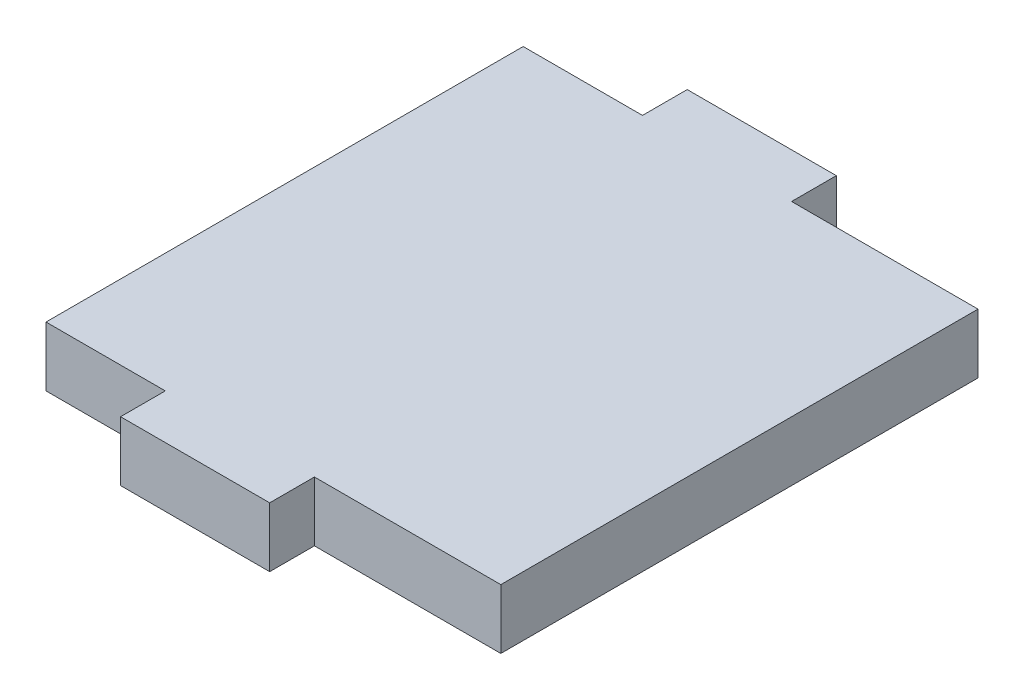
ISO-10303-21;
HEADER;
FILE_DESCRIPTION(('STEP AP214'),'2;1');
FILE_NAME('part.step','',(''),(''),'','','');
FILE_SCHEMA(('AUTOMOTIVE_DESIGN { 1 0 10303 214 1 1 1 1 }'));
ENDSEC;
DATA;
#1=APPLICATION_CONTEXT('core data for automotive mechanical design processes');
#2=APPLICATION_PROTOCOL_DEFINITION('international standard','automotive_design',2000,#1);
#3=PRODUCT_CONTEXT('',#1,'mechanical');
#4=PRODUCT('Part','Part','',(#3));
#5=PRODUCT_RELATED_PRODUCT_CATEGORY('part','',(#4));
#6=PRODUCT_DEFINITION_FORMATION('','',#4);
#7=PRODUCT_DEFINITION_CONTEXT('part definition',#1,'design');
#8=PRODUCT_DEFINITION('design','',#6,#7);
#9=PRODUCT_DEFINITION_SHAPE('','',#8);
#10=(LENGTH_UNIT() NAMED_UNIT(*) SI_UNIT(.MILLI.,.METRE.));
#11=(NAMED_UNIT(*) PLANE_ANGLE_UNIT() SI_UNIT($,.RADIAN.));
#12=(NAMED_UNIT(*) SI_UNIT($,.STERADIAN.) SOLID_ANGLE_UNIT());
#13=UNCERTAINTY_MEASURE_WITH_UNIT(LENGTH_MEASURE(1.E-05),#10,'distance_accuracy_value','');
#14=(GEOMETRIC_REPRESENTATION_CONTEXT(3) GLOBAL_UNCERTAINTY_ASSIGNED_CONTEXT((#13)) GLOBAL_UNIT_ASSIGNED_CONTEXT((#10,
#11,#12)) REPRESENTATION_CONTEXT('',''));
#15=CARTESIAN_POINT('',(0.,0.,0.));
#16=DIRECTION('',(0.,0.,1.));
#17=DIRECTION('',(1.,0.,0.));
#18=AXIS2_PLACEMENT_3D('',#15,#16,#17);
#19=CARTESIAN_POINT('',(2.75,4.,16.));
#20=DIRECTION('',(-1.,0.,0.));
#21=DIRECTION('',(0.,0.,1.));
#22=AXIS2_PLACEMENT_3D('',#19,#20,#21);
#23=PLANE('',#22);
#24=DIRECTION('',(0.,0.,-1.));
#25=VECTOR('',#24,1.);
#26=CARTESIAN_POINT('',(2.75,0.,16.));
#27=LINE('',#26,#25);
#28=CARTESIAN_POINT('',(2.75,0.,19.));
#29=VERTEX_POINT('',#28);
#30=CARTESIAN_POINT('',(2.75,0.,16.));
#31=VERTEX_POINT('',#30);
#32=EDGE_CURVE('E155',#29,#31,#27,.T.);
#33=ORIENTED_EDGE('',*,*,#32,.T.);
#34=DIRECTION('',(0.,-1.,0.));
#35=VECTOR('',#34,1.);
#36=CARTESIAN_POINT('',(2.75,4.,16.));
#37=LINE('',#36,#35);
#38=CARTESIAN_POINT('',(2.75,4.,16.));
#39=VERTEX_POINT('',#38);
#40=EDGE_CURVE('E11',#39,#31,#37,.T.);
#41=ORIENTED_EDGE('',*,*,#40,.F.);
#42=DIRECTION('',(0.,0.,-1.));
#43=VECTOR('',#42,1.);
#44=CARTESIAN_POINT('',(2.75,4.,16.));
#45=LINE('',#44,#43);
#46=CARTESIAN_POINT('',(2.75,4.,19.));
#47=VERTEX_POINT('',#46);
#48=EDGE_CURVE('E177',#47,#39,#45,.T.);
#49=ORIENTED_EDGE('',*,*,#48,.F.);
#50=DIRECTION('',(0.,-1.,0.));
#51=VECTOR('',#50,1.);
#52=CARTESIAN_POINT('',(2.75,4.,19.));
#53=LINE('',#52,#51);
#54=EDGE_CURVE('E151',#47,#29,#53,.T.);
#55=ORIENTED_EDGE('',*,*,#54,.T.);
#56=EDGE_LOOP('',(#33,#41,#49,#55));
#57=FACE_BOUND('',#56,.T.);
#58=ADVANCED_FACE('F35',(#57),#23,.F.);
#59=CARTESIAN_POINT('',(15.25,4.,16.));
#60=DIRECTION('',(0.,0.,-1.));
#61=DIRECTION('',(-1.,0.,0.));
#62=AXIS2_PLACEMENT_3D('',#59,#60,#61);
#63=PLANE('',#62);
#64=DIRECTION('',(1.,0.,0.));
#65=VECTOR('',#64,1.);
#66=CARTESIAN_POINT('',(15.25,0.,16.));
#67=LINE('',#66,#65);
#68=CARTESIAN_POINT('',(15.25,0.,16.));
#69=VERTEX_POINT('',#68);
#70=EDGE_CURVE('E158',#31,#69,#67,.T.);
#71=ORIENTED_EDGE('',*,*,#70,.T.);
#72=DIRECTION('',(0.,-1.,0.));
#73=VECTOR('',#72,1.);
#74=CARTESIAN_POINT('',(15.25,4.,16.));
#75=LINE('',#74,#73);
#76=CARTESIAN_POINT('',(15.25,4.,16.));
#77=VERTEX_POINT('',#76);
#78=EDGE_CURVE('E43',#77,#69,#75,.T.);
#79=ORIENTED_EDGE('',*,*,#78,.F.);
#80=DIRECTION('',(1.,0.,0.));
#81=VECTOR('',#80,1.);
#82=CARTESIAN_POINT('',(15.25,4.,16.));
#83=LINE('',#82,#81);
#84=EDGE_CURVE('E106',#39,#77,#83,.T.);
#85=ORIENTED_EDGE('',*,*,#84,.F.);
#86=ORIENTED_EDGE('',*,*,#40,.T.);
#87=EDGE_LOOP('',(#71,#79,#85,#86));
#88=FACE_BOUND('',#87,.T.);
#89=ADVANCED_FACE('F255',(#88),#63,.F.);
#90=CARTESIAN_POINT('',(15.25,4.,-16.));
#91=DIRECTION('',(-1.,0.,0.));
#92=DIRECTION('',(0.,0.,1.));
#93=AXIS2_PLACEMENT_3D('',#90,#91,#92);
#94=PLANE('',#93);
#95=DIRECTION('',(0.,0.,-1.));
#96=VECTOR('',#95,1.);
#97=CARTESIAN_POINT('',(15.25,0.,-16.));
#98=LINE('',#97,#96);
#99=CARTESIAN_POINT('',(15.25,0.,-16.));
#100=VERTEX_POINT('',#99);
#101=EDGE_CURVE('E160',#69,#100,#98,.T.);
#102=ORIENTED_EDGE('',*,*,#101,.T.);
#103=DIRECTION('',(0.,-1.,0.));
#104=VECTOR('',#103,1.);
#105=CARTESIAN_POINT('',(15.25,4.,-16.));
#106=LINE('',#105,#104);
#107=CARTESIAN_POINT('',(15.25,4.,-16.));
#108=VERTEX_POINT('',#107);
#109=EDGE_CURVE('E196',#108,#100,#106,.T.);
#110=ORIENTED_EDGE('',*,*,#109,.F.);
#111=DIRECTION('',(0.,0.,-1.));
#112=VECTOR('',#111,1.);
#113=CARTESIAN_POINT('',(15.25,4.,-16.));
#114=LINE('',#113,#112);
#115=EDGE_CURVE('E204',#77,#108,#114,.T.);
#116=ORIENTED_EDGE('',*,*,#115,.F.);
#117=ORIENTED_EDGE('',*,*,#78,.T.);
#118=EDGE_LOOP('',(#102,#110,#116,#117));
#119=FACE_BOUND('',#118,.T.);
#120=ADVANCED_FACE('F202',(#119),#94,.F.);
#121=CARTESIAN_POINT('',(2.75,4.,-16.));
#122=DIRECTION('',(0.,0.,1.));
#123=DIRECTION('',(1.,0.,0.));
#124=AXIS2_PLACEMENT_3D('',#121,#122,#123);
#125=PLANE('',#124);
#126=DIRECTION('',(-1.,0.,0.));
#127=VECTOR('',#126,1.);
#128=CARTESIAN_POINT('',(2.75,0.,-16.));
#129=LINE('',#128,#127);
#130=CARTESIAN_POINT('',(2.75,0.,-16.));
#131=VERTEX_POINT('',#130);
#132=EDGE_CURVE('E162',#100,#131,#129,.T.);
#133=ORIENTED_EDGE('',*,*,#132,.T.);
#134=DIRECTION('',(0.,-1.,0.));
#135=VECTOR('',#134,1.);
#136=CARTESIAN_POINT('',(2.75,4.,-16.));
#137=LINE('',#136,#135);
#138=CARTESIAN_POINT('',(2.75,4.,-16.));
#139=VERTEX_POINT('',#138);
#140=EDGE_CURVE('E193',#139,#131,#137,.T.);
#141=ORIENTED_EDGE('',*,*,#140,.F.);
#142=DIRECTION('',(-1.,0.,0.));
#143=VECTOR('',#142,1.);
#144=CARTESIAN_POINT('',(2.75,4.,-16.));
#145=LINE('',#144,#143);
#146=EDGE_CURVE('E222',#108,#139,#145,.T.);
#147=ORIENTED_EDGE('',*,*,#146,.F.);
#148=ORIENTED_EDGE('',*,*,#109,.T.);
#149=EDGE_LOOP('',(#133,#141,#147,#148));
#150=FACE_BOUND('',#149,.T.);
#151=ADVANCED_FACE('F213',(#150),#125,.F.);
#152=CARTESIAN_POINT('',(2.75,4.,-19.));
#153=DIRECTION('',(-1.,0.,0.));
#154=DIRECTION('',(0.,0.,1.));
#155=AXIS2_PLACEMENT_3D('',#152,#153,#154);
#156=PLANE('',#155);
#157=DIRECTION('',(0.,0.,-1.));
#158=VECTOR('',#157,1.);
#159=CARTESIAN_POINT('',(2.75,0.,-19.));
#160=LINE('',#159,#158);
#161=CARTESIAN_POINT('',(2.75,0.,-19.));
#162=VERTEX_POINT('',#161);
#163=EDGE_CURVE('E164',#131,#162,#160,.T.);
#164=ORIENTED_EDGE('',*,*,#163,.T.);
#165=DIRECTION('',(0.,-1.,0.));
#166=VECTOR('',#165,1.);
#167=CARTESIAN_POINT('',(2.75,4.,-19.));
#168=LINE('',#167,#166);
#169=CARTESIAN_POINT('',(2.75,4.,-19.));
#170=VERTEX_POINT('',#169);
#171=EDGE_CURVE('E190',#170,#162,#168,.T.);
#172=ORIENTED_EDGE('',*,*,#171,.F.);
#173=DIRECTION('',(0.,0.,-1.));
#174=VECTOR('',#173,1.);
#175=CARTESIAN_POINT('',(2.75,4.,-19.));
#176=LINE('',#175,#174);
#177=EDGE_CURVE('E219',#139,#170,#176,.T.);
#178=ORIENTED_EDGE('',*,*,#177,.F.);
#179=ORIENTED_EDGE('',*,*,#140,.T.);
#180=EDGE_LOOP('',(#164,#172,#178,#179));
#181=FACE_BOUND('',#180,.T.);
#182=ADVANCED_FACE('F217',(#181),#156,.F.);
#183=CARTESIAN_POINT('',(-7.25000000000001,4.,-19.));
#184=DIRECTION('',(0.,0.,1.));
#185=DIRECTION('',(1.,0.,0.));
#186=AXIS2_PLACEMENT_3D('',#183,#184,#185);
#187=PLANE('',#186);
#188=DIRECTION('',(-1.,0.,0.));
#189=VECTOR('',#188,1.);
#190=CARTESIAN_POINT('',(-7.25000000000001,0.,-19.));
#191=LINE('',#190,#189);
#192=CARTESIAN_POINT('',(-7.25000000000001,0.,-19.));
#193=VERTEX_POINT('',#192);
#194=EDGE_CURVE('E166',#162,#193,#191,.T.);
#195=ORIENTED_EDGE('',*,*,#194,.T.);
#196=DIRECTION('',(0.,-1.,0.));
#197=VECTOR('',#196,1.);
#198=CARTESIAN_POINT('',(-7.25000000000001,4.,-19.));
#199=LINE('',#198,#197);
#200=CARTESIAN_POINT('',(-7.25000000000001,4.,-19.));
#201=VERTEX_POINT('',#200);
#202=EDGE_CURVE('E187',#201,#193,#199,.T.);
#203=ORIENTED_EDGE('',*,*,#202,.F.);
#204=DIRECTION('',(-1.,0.,0.));
#205=VECTOR('',#204,1.);
#206=CARTESIAN_POINT('',(-7.25000000000001,4.,-19.));
#207=LINE('',#206,#205);
#208=EDGE_CURVE('E221',#170,#201,#207,.T.);
#209=ORIENTED_EDGE('',*,*,#208,.F.);
#210=ORIENTED_EDGE('',*,*,#171,.T.);
#211=EDGE_LOOP('',(#195,#203,#209,#210));
#212=FACE_BOUND('',#211,.T.);
#213=ADVANCED_FACE('F268',(#212),#187,.F.);
#214=CARTESIAN_POINT('',(-7.25000000000001,4.,-16.));
#215=DIRECTION('',(1.,0.,0.));
#216=DIRECTION('',(0.,0.,-1.));
#217=AXIS2_PLACEMENT_3D('',#214,#215,#216);
#218=PLANE('',#217);
#219=DIRECTION('',(0.,0.,1.));
#220=VECTOR('',#219,1.);
#221=CARTESIAN_POINT('',(-7.25000000000001,0.,-16.));
#222=LINE('',#221,#220);
#223=CARTESIAN_POINT('',(-7.25000000000001,0.,-16.));
#224=VERTEX_POINT('',#223);
#225=EDGE_CURVE('E168',#193,#224,#222,.T.);
#226=ORIENTED_EDGE('',*,*,#225,.T.);
#227=DIRECTION('',(0.,-1.,0.));
#228=VECTOR('',#227,1.);
#229=CARTESIAN_POINT('',(-7.25000000000001,4.,-16.));
#230=LINE('',#229,#228);
#231=CARTESIAN_POINT('',(-7.25000000000001,4.,-16.));
#232=VERTEX_POINT('',#231);
#233=EDGE_CURVE('E184',#232,#224,#230,.T.);
#234=ORIENTED_EDGE('',*,*,#233,.F.);
#235=DIRECTION('',(0.,0.,1.));
#236=VECTOR('',#235,1.);
#237=CARTESIAN_POINT('',(-7.25000000000001,4.,-16.));
#238=LINE('',#237,#236);
#239=EDGE_CURVE('E224',#201,#232,#238,.T.);
#240=ORIENTED_EDGE('',*,*,#239,.F.);
#241=ORIENTED_EDGE('',*,*,#202,.T.);
#242=EDGE_LOOP('',(#226,#234,#240,#241));
#243=FACE_BOUND('',#242,.T.);
#244=ADVANCED_FACE('F271',(#243),#218,.F.);
#245=CARTESIAN_POINT('',(-15.25,4.,-16.));
#246=DIRECTION('',(0.,0.,1.));
#247=DIRECTION('',(1.,0.,0.));
#248=AXIS2_PLACEMENT_3D('',#245,#246,#247);
#249=PLANE('',#248);
#250=DIRECTION('',(-1.,0.,0.));
#251=VECTOR('',#250,1.);
#252=CARTESIAN_POINT('',(-15.25,0.,-16.));
#253=LINE('',#252,#251);
#254=CARTESIAN_POINT('',(-15.25,0.,-16.));
#255=VERTEX_POINT('',#254);
#256=EDGE_CURVE('E170',#224,#255,#253,.T.);
#257=ORIENTED_EDGE('',*,*,#256,.T.);
#258=DIRECTION('',(0.,-1.,0.));
#259=VECTOR('',#258,1.);
#260=CARTESIAN_POINT('',(-15.25,4.,-16.));
#261=LINE('',#260,#259);
#262=CARTESIAN_POINT('',(-15.25,4.,-16.));
#263=VERTEX_POINT('',#262);
#264=EDGE_CURVE('E181',#263,#255,#261,.T.);
#265=ORIENTED_EDGE('',*,*,#264,.F.);
#266=DIRECTION('',(-1.,0.,0.));
#267=VECTOR('',#266,1.);
#268=CARTESIAN_POINT('',(-15.25,4.,-16.));
#269=LINE('',#268,#267);
#270=EDGE_CURVE('E230',#232,#263,#269,.T.);
#271=ORIENTED_EDGE('',*,*,#270,.F.);
#272=ORIENTED_EDGE('',*,*,#233,.T.);
#273=EDGE_LOOP('',(#257,#265,#271,#272));
#274=FACE_BOUND('',#273,.T.);
#275=ADVANCED_FACE('F236',(#274),#249,.F.);
#276=CARTESIAN_POINT('',(-15.25,4.,16.));
#277=DIRECTION('',(1.,0.,0.));
#278=DIRECTION('',(0.,0.,-1.));
#279=AXIS2_PLACEMENT_3D('',#276,#277,#278);
#280=PLANE('',#279);
#281=DIRECTION('',(0.,0.,1.));
#282=VECTOR('',#281,1.);
#283=CARTESIAN_POINT('',(-15.25,0.,16.));
#284=LINE('',#283,#282);
#285=CARTESIAN_POINT('',(-15.25,0.,16.));
#286=VERTEX_POINT('',#285);
#287=EDGE_CURVE('E172',#255,#286,#284,.T.);
#288=ORIENTED_EDGE('',*,*,#287,.T.);
#289=DIRECTION('',(0.,-1.,0.));
#290=VECTOR('',#289,1.);
#291=CARTESIAN_POINT('',(-15.25,4.,16.));
#292=LINE('',#291,#290);
#293=CARTESIAN_POINT('',(-15.25,4.,16.));
#294=VERTEX_POINT('',#293);
#295=EDGE_CURVE('E146',#294,#286,#292,.T.);
#296=ORIENTED_EDGE('',*,*,#295,.F.);
#297=DIRECTION('',(0.,0.,1.));
#298=VECTOR('',#297,1.);
#299=CARTESIAN_POINT('',(-15.25,4.,16.));
#300=LINE('',#299,#298);
#301=EDGE_CURVE('E137',#263,#294,#300,.T.);
#302=ORIENTED_EDGE('',*,*,#301,.F.);
#303=ORIENTED_EDGE('',*,*,#264,.T.);
#304=EDGE_LOOP('',(#288,#296,#302,#303));
#305=FACE_BOUND('',#304,.T.);
#306=ADVANCED_FACE('F240',(#305),#280,.F.);
#307=CARTESIAN_POINT('',(-7.25000000000001,4.,16.));
#308=DIRECTION('',(0.,0.,-1.));
#309=DIRECTION('',(-1.,0.,0.));
#310=AXIS2_PLACEMENT_3D('',#307,#308,#309);
#311=PLANE('',#310);
#312=DIRECTION('',(1.,0.,0.));
#313=VECTOR('',#312,1.);
#314=CARTESIAN_POINT('',(-7.25000000000001,0.,16.));
#315=LINE('',#314,#313);
#316=CARTESIAN_POINT('',(-7.25000000000001,0.,16.));
#317=VERTEX_POINT('',#316);
#318=EDGE_CURVE('E145',#286,#317,#315,.T.);
#319=ORIENTED_EDGE('',*,*,#318,.T.);
#320=DIRECTION('',(0.,-1.,0.));
#321=VECTOR('',#320,1.);
#322=CARTESIAN_POINT('',(-7.25000000000001,4.,16.));
#323=LINE('',#322,#321);
#324=CARTESIAN_POINT('',(-7.25000000000001,4.,16.));
#325=VERTEX_POINT('',#324);
#326=EDGE_CURVE('E142',#325,#317,#323,.T.);
#327=ORIENTED_EDGE('',*,*,#326,.F.);
#328=DIRECTION('',(1.,0.,0.));
#329=VECTOR('',#328,1.);
#330=CARTESIAN_POINT('',(-7.25000000000001,4.,16.));
#331=LINE('',#330,#329);
#332=EDGE_CURVE('E131',#294,#325,#331,.T.);
#333=ORIENTED_EDGE('',*,*,#332,.F.);
#334=ORIENTED_EDGE('',*,*,#295,.T.);
#335=EDGE_LOOP('',(#319,#327,#333,#334));
#336=FACE_BOUND('',#335,.T.);
#337=ADVANCED_FACE('F143',(#336),#311,.F.);
#338=CARTESIAN_POINT('',(-7.25000000000001,4.,19.));
#339=DIRECTION('',(1.,0.,0.));
#340=DIRECTION('',(0.,0.,-1.));
#341=AXIS2_PLACEMENT_3D('',#338,#339,#340);
#342=PLANE('',#341);
#343=DIRECTION('',(0.,0.,1.));
#344=VECTOR('',#343,1.);
#345=CARTESIAN_POINT('',(-7.25000000000001,0.,19.));
#346=LINE('',#345,#344);
#347=CARTESIAN_POINT('',(-7.25000000000001,0.,19.));
#348=VERTEX_POINT('',#347);
#349=EDGE_CURVE('E92',#317,#348,#346,.T.);
#350=ORIENTED_EDGE('',*,*,#349,.T.);
#351=DIRECTION('',(0.,-1.,0.));
#352=VECTOR('',#351,1.);
#353=CARTESIAN_POINT('',(-7.25000000000001,4.,19.));
#354=LINE('',#353,#352);
#355=CARTESIAN_POINT('',(-7.25000000000001,4.,19.));
#356=VERTEX_POINT('',#355);
#357=EDGE_CURVE('E147',#356,#348,#354,.T.);
#358=ORIENTED_EDGE('',*,*,#357,.F.);
#359=DIRECTION('',(0.,0.,1.));
#360=VECTOR('',#359,1.);
#361=CARTESIAN_POINT('',(-7.25000000000001,4.,19.));
#362=LINE('',#361,#360);
#363=EDGE_CURVE('E135',#325,#356,#362,.T.);
#364=ORIENTED_EDGE('',*,*,#363,.F.);
#365=ORIENTED_EDGE('',*,*,#326,.T.);
#366=EDGE_LOOP('',(#350,#358,#364,#365));
#367=FACE_BOUND('',#366,.T.);
#368=ADVANCED_FACE('F149',(#367),#342,.F.);
#369=CARTESIAN_POINT('',(2.75,4.,19.));
#370=DIRECTION('',(0.,0.,-1.));
#371=DIRECTION('',(-1.,0.,0.));
#372=AXIS2_PLACEMENT_3D('',#369,#370,#371);
#373=PLANE('',#372);
#374=DIRECTION('',(1.,0.,0.));
#375=VECTOR('',#374,1.);
#376=CARTESIAN_POINT('',(2.75,0.,19.));
#377=LINE('',#376,#375);
#378=EDGE_CURVE('E98',#348,#29,#377,.T.);
#379=ORIENTED_EDGE('',*,*,#378,.T.);
#380=ORIENTED_EDGE('',*,*,#54,.F.);
#381=DIRECTION('',(1.,0.,0.));
#382=VECTOR('',#381,1.);
#383=CARTESIAN_POINT('',(2.75,4.,19.));
#384=LINE('',#383,#382);
#385=EDGE_CURVE('E51',#356,#47,#384,.T.);
#386=ORIENTED_EDGE('',*,*,#385,.F.);
#387=ORIENTED_EDGE('',*,*,#357,.T.);
#388=EDGE_LOOP('',(#379,#380,#386,#387));
#389=FACE_BOUND('',#388,.T.);
#390=ADVANCED_FACE('F244',(#389),#373,.F.);
#391=CARTESIAN_POINT('',(0.,4.,0.));
#392=DIRECTION('',(0.,-1.,0.));
#393=DIRECTION('',(0.,0.,-1.));
#394=AXIS2_PLACEMENT_3D('',#391,#392,#393);
#395=PLANE('',#394);
#396=ORIENTED_EDGE('',*,*,#48,.T.);
#397=ORIENTED_EDGE('',*,*,#84,.T.);
#398=ORIENTED_EDGE('',*,*,#115,.T.);
#399=ORIENTED_EDGE('',*,*,#146,.T.);
#400=ORIENTED_EDGE('',*,*,#177,.T.);
#401=ORIENTED_EDGE('',*,*,#208,.T.);
#402=ORIENTED_EDGE('',*,*,#239,.T.);
#403=ORIENTED_EDGE('',*,*,#270,.T.);
#404=ORIENTED_EDGE('',*,*,#301,.T.);
#405=ORIENTED_EDGE('',*,*,#332,.T.);
#406=ORIENTED_EDGE('',*,*,#363,.T.);
#407=ORIENTED_EDGE('',*,*,#385,.T.);
#408=EDGE_LOOP('',(#396,#397,#398,#399,#400,#401,#402,#403,#404,#405,#406,#407));
#409=FACE_BOUND('',#408,.T.);
#410=ADVANCED_FACE('F133',(#409),#395,.F.);
#411=CARTESIAN_POINT('',(0.,0.,0.));
#412=DIRECTION('',(0.,-1.,0.));
#413=DIRECTION('',(0.,0.,-1.));
#414=AXIS2_PLACEMENT_3D('',#411,#412,#413);
#415=PLANE('',#414);
#416=ORIENTED_EDGE('',*,*,#32,.F.);
#417=ORIENTED_EDGE('',*,*,#378,.F.);
#418=ORIENTED_EDGE('',*,*,#349,.F.);
#419=ORIENTED_EDGE('',*,*,#318,.F.);
#420=ORIENTED_EDGE('',*,*,#287,.F.);
#421=ORIENTED_EDGE('',*,*,#256,.F.);
#422=ORIENTED_EDGE('',*,*,#225,.F.);
#423=ORIENTED_EDGE('',*,*,#194,.F.);
#424=ORIENTED_EDGE('',*,*,#163,.F.);
#425=ORIENTED_EDGE('',*,*,#132,.F.);
#426=ORIENTED_EDGE('',*,*,#101,.F.);
#427=ORIENTED_EDGE('',*,*,#70,.F.);
#428=EDGE_LOOP('',(#416,#417,#418,#419,#420,#421,#422,#423,#424,#425,#426,#427));
#429=FACE_BOUND('',#428,.T.);
#430=ADVANCED_FACE('F208',(#429),#415,.T.);
#431=CLOSED_SHELL('',(#58,#89,#120,#151,#182,#213,#244,#275,#306,#337,#368,#390,#410,#430));
#432=MANIFOLD_SOLID_BREP('B2',#431);
#433=ADVANCED_BREP_SHAPE_REPRESENTATION('',(#18,#432),#14);
#434=SHAPE_DEFINITION_REPRESENTATION(#9,#433);
ENDSEC;
END-ISO-10303-21;
